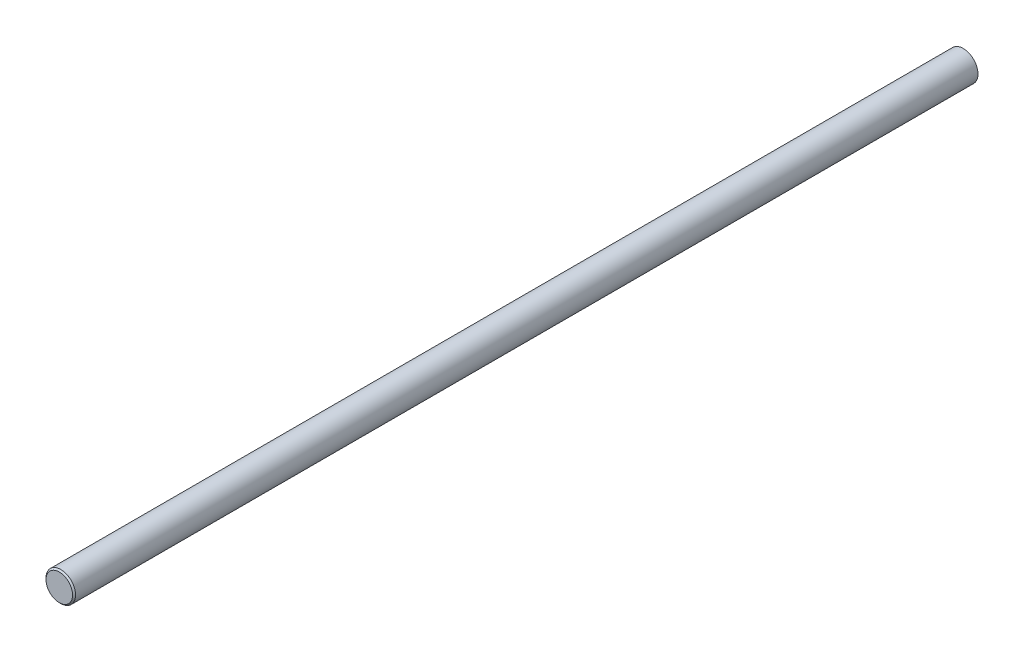
ISO-10303-21;
HEADER;
FILE_DESCRIPTION(('STEP AP214'),'2;1');
FILE_NAME('part.step','',(''),(''),'','','');
FILE_SCHEMA(('AUTOMOTIVE_DESIGN { 1 0 10303 214 1 1 1 1 }'));
ENDSEC;
DATA;
#1=APPLICATION_CONTEXT('core data for automotive mechanical design processes');
#2=APPLICATION_PROTOCOL_DEFINITION('international standard','automotive_design',2000,#1);
#3=PRODUCT_CONTEXT('',#1,'mechanical');
#4=PRODUCT('Part','Part','',(#3));
#5=PRODUCT_RELATED_PRODUCT_CATEGORY('part','',(#4));
#6=PRODUCT_DEFINITION_FORMATION('','',#4);
#7=PRODUCT_DEFINITION_CONTEXT('part definition',#1,'design');
#8=PRODUCT_DEFINITION('design','',#6,#7);
#9=PRODUCT_DEFINITION_SHAPE('','',#8);
#10=(LENGTH_UNIT() NAMED_UNIT(*) SI_UNIT(.MILLI.,.METRE.));
#11=(NAMED_UNIT(*) PLANE_ANGLE_UNIT() SI_UNIT($,.RADIAN.));
#12=(NAMED_UNIT(*) SI_UNIT($,.STERADIAN.) SOLID_ANGLE_UNIT());
#13=UNCERTAINTY_MEASURE_WITH_UNIT(LENGTH_MEASURE(1.E-05),#10,'distance_accuracy_value','');
#14=(GEOMETRIC_REPRESENTATION_CONTEXT(3) GLOBAL_UNCERTAINTY_ASSIGNED_CONTEXT((#13)) GLOBAL_UNIT_ASSIGNED_CONTEXT((#10,
#11,#12)) REPRESENTATION_CONTEXT('',''));
#15=CARTESIAN_POINT('',(0.,0.,0.));
#16=DIRECTION('',(0.,0.,1.));
#17=DIRECTION('',(1.,0.,0.));
#18=AXIS2_PLACEMENT_3D('',#15,#16,#17);
#19=CARTESIAN_POINT('',(0.,0.,1001.5875));
#20=DIRECTION('',(0.,0.,1.));
#21=DIRECTION('',(1.,0.,0.));
#22=AXIS2_PLACEMENT_3D('',#19,#20,#21);
#23=PLANE('',#22);
#24=CARTESIAN_POINT('',(0.,0.,1001.5875));
#25=DIRECTION('',(0.,0.,1.));
#26=DIRECTION('',(1.,0.,0.));
#27=AXIS2_PLACEMENT_3D('',#24,#25,#26);
#28=CIRCLE('',#27,15.48);
#29=CARTESIAN_POINT('',(15.48,0.,1001.5875));
#30=VERTEX_POINT('',#29);
#31=EDGE_CURVE('E17',#30,#30,#28,.F.);
#32=ORIENTED_EDGE('',*,*,#31,.T.);
#33=EDGE_LOOP('',(#32));
#34=FACE_BOUND('',#33,.T.);
#35=ADVANCED_FACE('F14',(#34),#23,.F.);
#36=CARTESIAN_POINT('',(0.,0.,0.));
#37=DIRECTION('',(0.,0.,1.));
#38=DIRECTION('',(1.,0.,0.));
#39=AXIS2_PLACEMENT_3D('',#36,#37,#38);
#40=CYLINDRICAL_SURFACE('',#39,15.48);
#41=CARTESIAN_POINT('',(0.,0.,0.));
#42=DIRECTION('',(0.,0.,1.));
#43=DIRECTION('',(1.,0.,0.));
#44=AXIS2_PLACEMENT_3D('',#41,#42,#43);
#45=CIRCLE('',#44,15.48);
#46=CARTESIAN_POINT('',(15.48,0.,0.));
#47=VERTEX_POINT('',#46);
#48=EDGE_CURVE('E30',#47,#47,#45,.F.);
#49=ORIENTED_EDGE('',*,*,#48,.T.);
#50=EDGE_LOOP('',(#49));
#51=FACE_BOUND('',#50,.T.);
#52=ORIENTED_EDGE('',*,*,#31,.F.);
#53=EDGE_LOOP('',(#52));
#54=FACE_BOUND('',#53,.T.);
#55=ADVANCED_FACE('F38',(#51,#54),#40,.F.);
#56=CARTESIAN_POINT('',(0.,15.075,1025.5));
#57=DIRECTION('',(0.,0.,-1.));
#58=DIRECTION('',(-1.,0.,0.));
#59=AXIS2_PLACEMENT_3D('',#56,#57,#58);
#60=PLANE('',#59);
#61=CARTESIAN_POINT('',(0.,0.,1025.5));
#62=DIRECTION('',(0.,0.,-1.));
#63=DIRECTION('',(-1.,0.,0.));
#64=AXIS2_PLACEMENT_3D('',#61,#62,#63);
#65=CIRCLE('',#64,15.075);
#66=CARTESIAN_POINT('',(-15.075,0.,1025.5));
#67=VERTEX_POINT('',#66);
#68=EDGE_CURVE('E26',#67,#67,#65,.T.);
#69=ORIENTED_EDGE('',*,*,#68,.F.);
#70=EDGE_LOOP('',(#69));
#71=FACE_BOUND('',#70,.T.);
#72=ADVANCED_FACE('F40',(#71),#60,.F.);
#73=CARTESIAN_POINT('',(0.,15.48,0.));
#74=DIRECTION('',(0.,0.,1.));
#75=DIRECTION('',(1.,0.,0.));
#76=AXIS2_PLACEMENT_3D('',#73,#74,#75);
#77=PLANE('',#76);
#78=ORIENTED_EDGE('',*,*,#48,.F.);
#79=EDGE_LOOP('',(#78));
#80=FACE_BOUND('',#79,.T.);
#81=CARTESIAN_POINT('',(0.,0.,0.));
#82=DIRECTION('',(0.,0.,1.));
#83=DIRECTION('',(1.,0.,0.));
#84=AXIS2_PLACEMENT_3D('',#81,#82,#83);
#85=CIRCLE('',#84,16.7499999999999);
#86=CARTESIAN_POINT('',(16.7499999999999,0.,0.));
#87=VERTEX_POINT('',#86);
#88=EDGE_CURVE('E21',#87,#87,#85,.T.);
#89=ORIENTED_EDGE('',*,*,#88,.F.);
#90=EDGE_LOOP('',(#89));
#91=FACE_BOUND('',#90,.T.);
#92=ADVANCED_FACE('F46',(#80,#91),#77,.F.);
#93=CARTESIAN_POINT('',(0.,0.,1023.825));
#94=DIRECTION('',(0.,0.,-1.));
#95=DIRECTION('',(-1.,0.,0.));
#96=AXIS2_PLACEMENT_3D('',#93,#94,#95);
#97=CONICAL_SURFACE('',#96,16.7499999999999,0.785398163397523);
#98=CARTESIAN_POINT('',(0.,0.,1023.825));
#99=DIRECTION('',(0.,0.,1.));
#100=DIRECTION('',(1.,0.,0.));
#101=AXIS2_PLACEMENT_3D('',#98,#99,#100);
#102=CIRCLE('',#101,16.7499999999999);
#103=CARTESIAN_POINT('',(16.7499999999999,0.,1023.825));
#104=VERTEX_POINT('',#103);
#105=EDGE_CURVE('E10',#104,#104,#102,.F.);
#106=ORIENTED_EDGE('',*,*,#105,.F.);
#107=EDGE_LOOP('',(#106));
#108=FACE_BOUND('',#107,.T.);
#109=ORIENTED_EDGE('',*,*,#68,.T.);
#110=EDGE_LOOP('',(#109));
#111=FACE_BOUND('',#110,.T.);
#112=ADVANCED_FACE('F51',(#108,#111),#97,.T.);
#113=CARTESIAN_POINT('',(0.,0.,0.));
#114=DIRECTION('',(0.,0.,1.));
#115=DIRECTION('',(1.,0.,0.));
#116=AXIS2_PLACEMENT_3D('',#113,#114,#115);
#117=CYLINDRICAL_SURFACE('',#116,16.7499999999999);
#118=ORIENTED_EDGE('',*,*,#105,.T.);
#119=EDGE_LOOP('',(#118));
#120=FACE_BOUND('',#119,.T.);
#121=ORIENTED_EDGE('',*,*,#88,.T.);
#122=EDGE_LOOP('',(#121));
#123=FACE_BOUND('',#122,.T.);
#124=ADVANCED_FACE('F49',(#120,#123),#117,.T.);
#125=CLOSED_SHELL('',(#35,#55,#72,#92,#112,#124));
#126=MANIFOLD_SOLID_BREP('B1',#125);
#127=ADVANCED_BREP_SHAPE_REPRESENTATION('',(#18,#126),#14);
#128=SHAPE_DEFINITION_REPRESENTATION(#9,#127);
ENDSEC;
END-ISO-10303-21;
